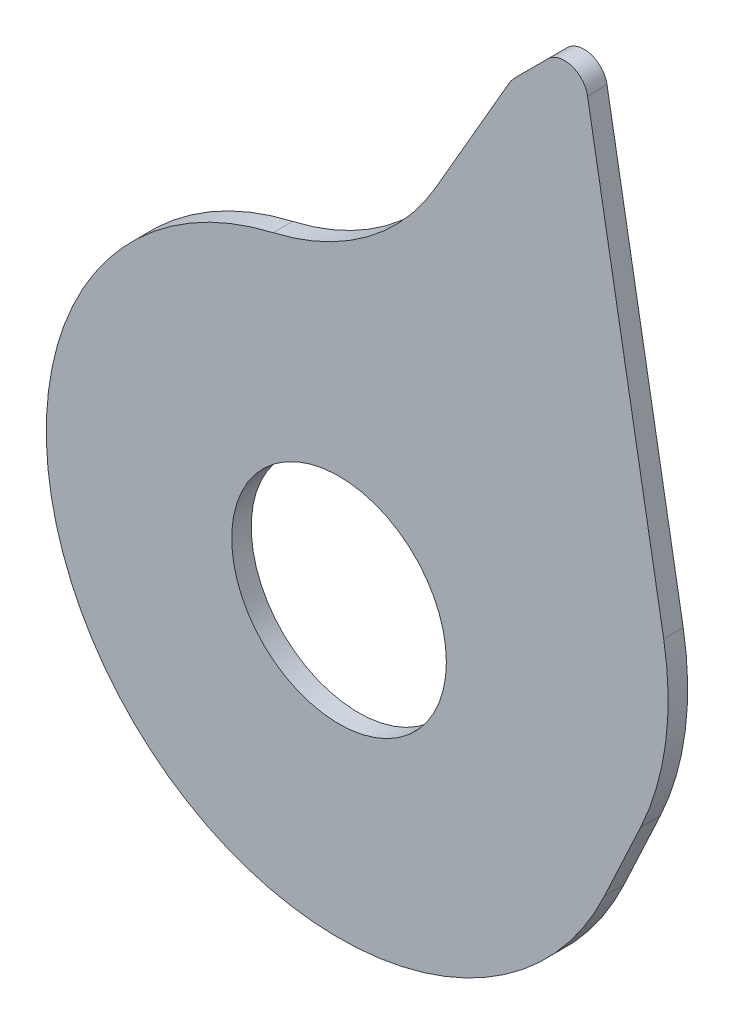
ISO-10303-21;
HEADER;
FILE_DESCRIPTION(('STEP AP214'),'2;1');
FILE_NAME('part.step','',(''),(''),'','','');
FILE_SCHEMA(('AUTOMOTIVE_DESIGN { 1 0 10303 214 1 1 1 1 }'));
ENDSEC;
DATA;
#1=APPLICATION_CONTEXT('core data for automotive mechanical design processes');
#2=APPLICATION_PROTOCOL_DEFINITION('international standard','automotive_design',2000,#1);
#3=PRODUCT_CONTEXT('',#1,'mechanical');
#4=PRODUCT('Part','Part','',(#3));
#5=PRODUCT_RELATED_PRODUCT_CATEGORY('part','',(#4));
#6=PRODUCT_DEFINITION_FORMATION('','',#4);
#7=PRODUCT_DEFINITION_CONTEXT('part definition',#1,'design');
#8=PRODUCT_DEFINITION('design','',#6,#7);
#9=PRODUCT_DEFINITION_SHAPE('','',#8);
#10=(LENGTH_UNIT() NAMED_UNIT(*) SI_UNIT(.MILLI.,.METRE.));
#11=(NAMED_UNIT(*) PLANE_ANGLE_UNIT() SI_UNIT($,.RADIAN.));
#12=(NAMED_UNIT(*) SI_UNIT($,.STERADIAN.) SOLID_ANGLE_UNIT());
#13=UNCERTAINTY_MEASURE_WITH_UNIT(LENGTH_MEASURE(1.E-05),#10,'distance_accuracy_value','');
#14=(GEOMETRIC_REPRESENTATION_CONTEXT(3) GLOBAL_UNCERTAINTY_ASSIGNED_CONTEXT((#13)) GLOBAL_UNIT_ASSIGNED_CONTEXT((#10,
#11,#12)) REPRESENTATION_CONTEXT('',''));
#15=CARTESIAN_POINT('',(0.,0.,0.));
#16=DIRECTION('',(0.,0.,1.));
#17=DIRECTION('',(1.,0.,0.));
#18=AXIS2_PLACEMENT_3D('',#15,#16,#17);
#19=CARTESIAN_POINT('',(0.,0.,5.));
#20=DIRECTION('',(0.,0.,1.));
#21=DIRECTION('',(1.,0.,0.));
#22=AXIS2_PLACEMENT_3D('',#19,#20,#21);
#23=PLANE('',#22);
#24=CARTESIAN_POINT('',(0.,0.,5.));
#25=DIRECTION('',(0.,0.,1.));
#26=DIRECTION('',(1.,0.,0.));
#27=AXIS2_PLACEMENT_3D('',#24,#25,#26);
#28=CIRCLE('',#27,75.);
#29=CARTESIAN_POINT('',(-16.8857684014529,73.0744197752709,5.));
#30=VERTEX_POINT('',#29);
#31=CARTESIAN_POINT('',(67.9730840277487,-31.6963696305528,5.));
#32=VERTEX_POINT('',#31);
#33=EDGE_CURVE('E159',#30,#32,#28,.T.);
#34=ORIENTED_EDGE('',*,*,#33,.T.);
#35=DIRECTION('',(0.422618261740703,0.906307787036648,0.));
#36=VECTOR('',#35,1.);
#37=CARTESIAN_POINT('',(77.286827824146,-11.7229816033258,5.));
#38=LINE('',#37,#36);
#39=CARTESIAN_POINT('',(77.286827824146,-11.7229816033258,5.));
#40=VERTEX_POINT('',#39);
#41=EDGE_CURVE('E102',#32,#40,#38,.T.);
#42=ORIENTED_EDGE('',*,*,#41,.T.);
#43=CARTESIAN_POINT('',(9.31374379639742,19.9733880272269,5.));
#44=DIRECTION('',(0.,0.,1.));
#45=DIRECTION('',(-1.,0.,0.));
#46=AXIS2_PLACEMENT_3D('',#43,#44,#45);
#47=CIRCLE('',#46,75.);
#48=CARTESIAN_POINT('',(83.1743252723131,32.9970013522465,5.));
#49=VERTEX_POINT('',#48);
#50=EDGE_CURVE('E177',#40,#49,#47,.T.);
#51=ORIENTED_EDGE('',*,*,#50,.T.);
#52=DIRECTION('',(-0.173648177666927,0.984807753012209,0.));
#53=VECTOR('',#52,1.);
#54=CARTESIAN_POINT('',(63.6633551574518,143.649211447765,5.));
#55=LINE('',#54,#53);
#56=CARTESIAN_POINT('',(63.6633551574518,143.649211447765,5.));
#57=VERTEX_POINT('',#56);
#58=EDGE_CURVE('E194',#49,#57,#55,.T.);
#59=ORIENTED_EDGE('',*,*,#58,.T.);
#60=CARTESIAN_POINT('',(57.7545086393786,142.607322381764,5.));
#61=DIRECTION('',(0.,0.,1.));
#62=DIRECTION('',(-1.,0.,0.));
#63=AXIS2_PLACEMENT_3D('',#60,#61,#62);
#64=CIRCLE('',#63,6.00000000000001);
#65=CARTESIAN_POINT('',(53.5118679522593,146.849963068883,5.));
#66=VERTEX_POINT('',#65);
#67=EDGE_CURVE('E193',#57,#66,#64,.T.);
#68=ORIENTED_EDGE('',*,*,#67,.T.);
#69=DIRECTION('',(-0.707106781186549,-0.707106781186546,0.));
#70=VECTOR('',#69,1.);
#71=CARTESIAN_POINT('',(45.1055831773481,138.443678293972,5.));
#72=LINE('',#71,#70);
#73=CARTESIAN_POINT('',(45.1055831773481,138.443678293972,5.));
#74=VERTEX_POINT('',#73);
#75=EDGE_CURVE('E124',#66,#74,#72,.T.);
#76=ORIENTED_EDGE('',*,*,#75,.T.);
#77=CARTESIAN_POINT('',(52.1766509892135,131.372610482106,5.));
#78=DIRECTION('',(0.,0.,1.));
#79=DIRECTION('',(-1.,0.,0.));
#80=AXIS2_PLACEMENT_3D('',#77,#78,#79);
#81=CIRCLE('',#80,10.);
#82=CARTESIAN_POINT('',(43.5163969513692,136.372610482106,5.));
#83=VERTEX_POINT('',#82);
#84=EDGE_CURVE('E118',#74,#83,#81,.T.);
#85=ORIENTED_EDGE('',*,*,#84,.T.);
#86=DIRECTION('',(-0.500000000000002,-0.866025403784438,0.));
#87=VECTOR('',#86,1.);
#88=CARTESIAN_POINT('',(24.771550229943,103.905583580506,5.));
#89=LINE('',#88,#87);
#90=CARTESIAN_POINT('',(24.771550229943,103.905583580506,5.));
#91=VERTEX_POINT('',#90);
#92=EDGE_CURVE('E122',#83,#91,#89,.T.);
#93=ORIENTED_EDGE('',*,*,#92,.T.);
#94=CARTESIAN_POINT('',(-31.5201010160455,136.405583580506,5.));
#95=DIRECTION('',(0.,0.,-1.));
#96=DIRECTION('',(-1.,0.,0.));
#97=AXIS2_PLACEMENT_3D('',#94,#95,#96);
#98=CIRCLE('',#97,65.);
#99=EDGE_CURVE('E56',#91,#30,#98,.T.);
#100=ORIENTED_EDGE('',*,*,#99,.T.);
#101=EDGE_LOOP('',(#34,#42,#51,#59,#68,#76,#85,#93,#100));
#102=FACE_BOUND('',#101,.T.);
#103=CARTESIAN_POINT('',(0.,0.,5.));
#104=DIRECTION('',(0.,0.,1.));
#105=DIRECTION('',(1.,0.,0.));
#106=AXIS2_PLACEMENT_3D('',#103,#104,#105);
#107=CIRCLE('',#106,27.5);
#108=CARTESIAN_POINT('',(27.5,0.,5.));
#109=VERTEX_POINT('',#108);
#110=EDGE_CURVE('E146',#109,#109,#107,.T.);
#111=ORIENTED_EDGE('',*,*,#110,.F.);
#112=EDGE_LOOP('',(#111));
#113=FACE_BOUND('',#112,.T.);
#114=ADVANCED_FACE('F39',(#102,#113),#23,.T.);
#115=CARTESIAN_POINT('',(0.,0.,0.));
#116=DIRECTION('',(0.,0.,1.));
#117=DIRECTION('',(1.,0.,0.));
#118=AXIS2_PLACEMENT_3D('',#115,#116,#117);
#119=PLANE('',#118);
#120=CARTESIAN_POINT('',(0.,0.,0.));
#121=DIRECTION('',(0.,0.,1.));
#122=DIRECTION('',(1.,0.,0.));
#123=AXIS2_PLACEMENT_3D('',#120,#121,#122);
#124=CIRCLE('',#123,75.);
#125=CARTESIAN_POINT('',(-16.8857684014529,73.0744197752709,0.));
#126=VERTEX_POINT('',#125);
#127=CARTESIAN_POINT('',(67.9730840277487,-31.6963696305528,0.));
#128=VERTEX_POINT('',#127);
#129=EDGE_CURVE('E142',#126,#128,#124,.T.);
#130=ORIENTED_EDGE('',*,*,#129,.F.);
#131=CARTESIAN_POINT('',(-31.5201010160455,136.405583580506,0.));
#132=DIRECTION('',(0.,0.,-1.));
#133=DIRECTION('',(-1.,0.,0.));
#134=AXIS2_PLACEMENT_3D('',#131,#132,#133);
#135=CIRCLE('',#134,65.);
#136=CARTESIAN_POINT('',(24.771550229943,103.905583580506,0.));
#137=VERTEX_POINT('',#136);
#138=EDGE_CURVE('E94',#137,#126,#135,.T.);
#139=ORIENTED_EDGE('',*,*,#138,.F.);
#140=DIRECTION('',(-0.500000000000002,-0.866025403784438,0.));
#141=VECTOR('',#140,1.);
#142=CARTESIAN_POINT('',(24.771550229943,103.905583580506,0.));
#143=LINE('',#142,#141);
#144=CARTESIAN_POINT('',(43.5163969513692,136.372610482106,0.));
#145=VERTEX_POINT('',#144);
#146=EDGE_CURVE('E88',#145,#137,#143,.T.);
#147=ORIENTED_EDGE('',*,*,#146,.F.);
#148=CARTESIAN_POINT('',(52.1766509892135,131.372610482106,0.));
#149=DIRECTION('',(0.,0.,1.));
#150=DIRECTION('',(-1.,0.,0.));
#151=AXIS2_PLACEMENT_3D('',#148,#149,#150);
#152=CIRCLE('',#151,10.);
#153=CARTESIAN_POINT('',(45.1055831773481,138.443678293972,0.));
#154=VERTEX_POINT('',#153);
#155=EDGE_CURVE('E132',#154,#145,#152,.T.);
#156=ORIENTED_EDGE('',*,*,#155,.F.);
#157=DIRECTION('',(-0.707106781186549,-0.707106781186546,0.));
#158=VECTOR('',#157,1.);
#159=CARTESIAN_POINT('',(45.1055831773481,138.443678293972,0.));
#160=LINE('',#159,#158);
#161=CARTESIAN_POINT('',(53.5118679522593,146.849963068883,0.));
#162=VERTEX_POINT('',#161);
#163=EDGE_CURVE('E154',#162,#154,#160,.T.);
#164=ORIENTED_EDGE('',*,*,#163,.F.);
#165=CARTESIAN_POINT('',(57.7545086393786,142.607322381764,0.));
#166=DIRECTION('',(0.,0.,1.));
#167=DIRECTION('',(-1.,0.,0.));
#168=AXIS2_PLACEMENT_3D('',#165,#166,#167);
#169=CIRCLE('',#168,6.00000000000001);
#170=CARTESIAN_POINT('',(63.6633551574518,143.649211447765,0.));
#171=VERTEX_POINT('',#170);
#172=EDGE_CURVE('E152',#171,#162,#169,.T.);
#173=ORIENTED_EDGE('',*,*,#172,.F.);
#174=DIRECTION('',(-0.173648177666927,0.984807753012209,0.));
#175=VECTOR('',#174,1.);
#176=CARTESIAN_POINT('',(63.6633551574518,143.649211447765,0.));
#177=LINE('',#176,#175);
#178=CARTESIAN_POINT('',(83.1743252723131,32.9970013522465,0.));
#179=VERTEX_POINT('',#178);
#180=EDGE_CURVE('E150',#179,#171,#177,.T.);
#181=ORIENTED_EDGE('',*,*,#180,.F.);
#182=CARTESIAN_POINT('',(9.31374379639742,19.9733880272269,0.));
#183=DIRECTION('',(0.,0.,1.));
#184=DIRECTION('',(-1.,0.,0.));
#185=AXIS2_PLACEMENT_3D('',#182,#183,#184);
#186=CIRCLE('',#185,75.);
#187=CARTESIAN_POINT('',(77.286827824146,-11.7229816033258,0.));
#188=VERTEX_POINT('',#187);
#189=EDGE_CURVE('E148',#188,#179,#186,.T.);
#190=ORIENTED_EDGE('',*,*,#189,.F.);
#191=DIRECTION('',(0.422618261740703,0.906307787036648,0.));
#192=VECTOR('',#191,1.);
#193=CARTESIAN_POINT('',(77.286827824146,-11.7229816033258,0.));
#194=LINE('',#193,#192);
#195=EDGE_CURVE('E145',#128,#188,#194,.T.);
#196=ORIENTED_EDGE('',*,*,#195,.F.);
#197=EDGE_LOOP('',(#130,#139,#147,#156,#164,#173,#181,#190,#196));
#198=FACE_BOUND('',#197,.T.);
#199=CARTESIAN_POINT('',(0.,0.,0.));
#200=DIRECTION('',(0.,0.,1.));
#201=DIRECTION('',(1.,0.,0.));
#202=AXIS2_PLACEMENT_3D('',#199,#200,#201);
#203=CIRCLE('',#202,27.5);
#204=CARTESIAN_POINT('',(27.5,0.,0.));
#205=VERTEX_POINT('',#204);
#206=EDGE_CURVE('E201',#205,#205,#203,.T.);
#207=ORIENTED_EDGE('',*,*,#206,.T.);
#208=EDGE_LOOP('',(#207));
#209=FACE_BOUND('',#208,.T.);
#210=ADVANCED_FACE('F181',(#198,#209),#119,.F.);
#211=CARTESIAN_POINT('',(0.,0.,5.));
#212=DIRECTION('',(0.,0.,-1.));
#213=DIRECTION('',(-1.,0.,0.));
#214=AXIS2_PLACEMENT_3D('',#211,#212,#213);
#215=CYLINDRICAL_SURFACE('',#214,75.);
#216=ORIENTED_EDGE('',*,*,#129,.T.);
#217=DIRECTION('',(0.,0.,-1.));
#218=VECTOR('',#217,1.);
#219=CARTESIAN_POINT('',(67.9730840277487,-31.6963696305528,5.));
#220=LINE('',#219,#218);
#221=EDGE_CURVE('E11',#32,#128,#220,.T.);
#222=ORIENTED_EDGE('',*,*,#221,.F.);
#223=ORIENTED_EDGE('',*,*,#33,.F.);
#224=DIRECTION('',(0.,0.,-1.));
#225=VECTOR('',#224,1.);
#226=CARTESIAN_POINT('',(-16.8857684014529,73.0744197752709,5.));
#227=LINE('',#226,#225);
#228=EDGE_CURVE('E138',#30,#126,#227,.T.);
#229=ORIENTED_EDGE('',*,*,#228,.T.);
#230=EDGE_LOOP('',(#216,#222,#223,#229));
#231=FACE_BOUND('',#230,.T.);
#232=ADVANCED_FACE('F41',(#231),#215,.T.);
#233=CARTESIAN_POINT('',(77.286827824146,-11.7229816033258,5.));
#234=DIRECTION('',(-0.906307787036648,0.422618261740703,0.));
#235=DIRECTION('',(-0.422618261740703,-0.906307787036648,0.));
#236=AXIS2_PLACEMENT_3D('',#233,#234,#235);
#237=PLANE('',#236);
#238=ORIENTED_EDGE('',*,*,#195,.T.);
#239=DIRECTION('',(0.,0.,-1.));
#240=VECTOR('',#239,1.);
#241=CARTESIAN_POINT('',(77.286827824146,-11.7229816033258,5.));
#242=LINE('',#241,#240);
#243=EDGE_CURVE('E48',#40,#188,#242,.T.);
#244=ORIENTED_EDGE('',*,*,#243,.F.);
#245=ORIENTED_EDGE('',*,*,#41,.F.);
#246=ORIENTED_EDGE('',*,*,#221,.T.);
#247=EDGE_LOOP('',(#238,#244,#245,#246));
#248=FACE_BOUND('',#247,.T.);
#249=ADVANCED_FACE('F233',(#248),#237,.F.);
#250=CARTESIAN_POINT('',(9.31374379639742,19.9733880272269,5.));
#251=DIRECTION('',(0.,0.,-1.));
#252=DIRECTION('',(-1.,0.,0.));
#253=AXIS2_PLACEMENT_3D('',#250,#251,#252);
#254=CYLINDRICAL_SURFACE('',#253,75.);
#255=ORIENTED_EDGE('',*,*,#189,.T.);
#256=DIRECTION('',(0.,0.,-1.));
#257=VECTOR('',#256,1.);
#258=CARTESIAN_POINT('',(83.1743252723131,32.9970013522465,5.));
#259=LINE('',#258,#257);
#260=EDGE_CURVE('E169',#49,#179,#259,.T.);
#261=ORIENTED_EDGE('',*,*,#260,.F.);
#262=ORIENTED_EDGE('',*,*,#50,.F.);
#263=ORIENTED_EDGE('',*,*,#243,.T.);
#264=EDGE_LOOP('',(#255,#261,#262,#263));
#265=FACE_BOUND('',#264,.T.);
#266=ADVANCED_FACE('F175',(#265),#254,.T.);
#267=CARTESIAN_POINT('',(63.6633551574518,143.649211447765,5.));
#268=DIRECTION('',(-0.984807753012209,-0.173648177666927,0.));
#269=DIRECTION('',(0.173648177666927,-0.984807753012209,0.));
#270=AXIS2_PLACEMENT_3D('',#267,#268,#269);
#271=PLANE('',#270);
#272=ORIENTED_EDGE('',*,*,#180,.T.);
#273=DIRECTION('',(0.,0.,-1.));
#274=VECTOR('',#273,1.);
#275=CARTESIAN_POINT('',(63.6633551574518,143.649211447765,5.));
#276=LINE('',#275,#274);
#277=EDGE_CURVE('E166',#57,#171,#276,.T.);
#278=ORIENTED_EDGE('',*,*,#277,.F.);
#279=ORIENTED_EDGE('',*,*,#58,.F.);
#280=ORIENTED_EDGE('',*,*,#260,.T.);
#281=EDGE_LOOP('',(#272,#278,#279,#280));
#282=FACE_BOUND('',#281,.T.);
#283=ADVANCED_FACE('F187',(#282),#271,.F.);
#284=CARTESIAN_POINT('',(57.7545086393786,142.607322381764,5.));
#285=DIRECTION('',(0.,0.,-1.));
#286=DIRECTION('',(-1.,0.,0.));
#287=AXIS2_PLACEMENT_3D('',#284,#285,#286);
#288=CYLINDRICAL_SURFACE('',#287,6.00000000000001);
#289=ORIENTED_EDGE('',*,*,#172,.T.);
#290=DIRECTION('',(0.,0.,-1.));
#291=VECTOR('',#290,1.);
#292=CARTESIAN_POINT('',(53.5118679522593,146.849963068883,5.));
#293=LINE('',#292,#291);
#294=EDGE_CURVE('E163',#66,#162,#293,.T.);
#295=ORIENTED_EDGE('',*,*,#294,.F.);
#296=ORIENTED_EDGE('',*,*,#67,.F.);
#297=ORIENTED_EDGE('',*,*,#277,.T.);
#298=EDGE_LOOP('',(#289,#295,#296,#297));
#299=FACE_BOUND('',#298,.T.);
#300=ADVANCED_FACE('F191',(#299),#288,.T.);
#301=CARTESIAN_POINT('',(45.1055831773481,138.443678293972,5.));
#302=DIRECTION('',(0.707106781186546,-0.707106781186549,0.));
#303=DIRECTION('',(0.707106781186549,0.707106781186546,0.));
#304=AXIS2_PLACEMENT_3D('',#301,#302,#303);
#305=PLANE('',#304);
#306=ORIENTED_EDGE('',*,*,#163,.T.);
#307=DIRECTION('',(0.,0.,-1.));
#308=VECTOR('',#307,1.);
#309=CARTESIAN_POINT('',(45.1055831773481,138.443678293972,5.));
#310=LINE('',#309,#308);
#311=EDGE_CURVE('E133',#74,#154,#310,.T.);
#312=ORIENTED_EDGE('',*,*,#311,.F.);
#313=ORIENTED_EDGE('',*,*,#75,.F.);
#314=ORIENTED_EDGE('',*,*,#294,.T.);
#315=EDGE_LOOP('',(#306,#312,#313,#314));
#316=FACE_BOUND('',#315,.T.);
#317=ADVANCED_FACE('F224',(#316),#305,.F.);
#318=CARTESIAN_POINT('',(52.1766509892135,131.372610482106,5.));
#319=DIRECTION('',(0.,0.,-1.));
#320=DIRECTION('',(-1.,0.,0.));
#321=AXIS2_PLACEMENT_3D('',#318,#319,#320);
#322=CYLINDRICAL_SURFACE('',#321,10.);
#323=ORIENTED_EDGE('',*,*,#155,.T.);
#324=DIRECTION('',(0.,0.,-1.));
#325=VECTOR('',#324,1.);
#326=CARTESIAN_POINT('',(43.5163969513692,136.372610482106,5.));
#327=LINE('',#326,#325);
#328=EDGE_CURVE('E129',#83,#145,#327,.T.);
#329=ORIENTED_EDGE('',*,*,#328,.F.);
#330=ORIENTED_EDGE('',*,*,#84,.F.);
#331=ORIENTED_EDGE('',*,*,#311,.T.);
#332=EDGE_LOOP('',(#323,#329,#330,#331));
#333=FACE_BOUND('',#332,.T.);
#334=ADVANCED_FACE('F130',(#333),#322,.T.);
#335=CARTESIAN_POINT('',(24.771550229943,103.905583580506,5.));
#336=DIRECTION('',(0.866025403784438,-0.500000000000002,0.));
#337=DIRECTION('',(0.500000000000002,0.866025403784438,0.));
#338=AXIS2_PLACEMENT_3D('',#335,#336,#337);
#339=PLANE('',#338);
#340=ORIENTED_EDGE('',*,*,#146,.T.);
#341=DIRECTION('',(0.,0.,-1.));
#342=VECTOR('',#341,1.);
#343=CARTESIAN_POINT('',(24.771550229943,103.905583580506,5.));
#344=LINE('',#343,#342);
#345=EDGE_CURVE('E134',#91,#137,#344,.T.);
#346=ORIENTED_EDGE('',*,*,#345,.F.);
#347=ORIENTED_EDGE('',*,*,#92,.F.);
#348=ORIENTED_EDGE('',*,*,#328,.T.);
#349=EDGE_LOOP('',(#340,#346,#347,#348));
#350=FACE_BOUND('',#349,.T.);
#351=ADVANCED_FACE('F136',(#350),#339,.F.);
#352=CARTESIAN_POINT('',(-31.5201010160455,136.405583580506,5.));
#353=DIRECTION('',(0.,0.,-1.));
#354=DIRECTION('',(-1.,0.,0.));
#355=AXIS2_PLACEMENT_3D('',#352,#353,#354);
#356=CYLINDRICAL_SURFACE('',#355,65.);
#357=ORIENTED_EDGE('',*,*,#138,.T.);
#358=ORIENTED_EDGE('',*,*,#228,.F.);
#359=ORIENTED_EDGE('',*,*,#99,.F.);
#360=ORIENTED_EDGE('',*,*,#345,.T.);
#361=EDGE_LOOP('',(#357,#358,#359,#360));
#362=FACE_BOUND('',#361,.T.);
#363=ADVANCED_FACE('F217',(#362),#356,.F.);
#364=CARTESIAN_POINT('',(0.,0.,5.));
#365=DIRECTION('',(0.,0.,-1.));
#366=DIRECTION('',(-1.,0.,0.));
#367=AXIS2_PLACEMENT_3D('',#364,#365,#366);
#368=CYLINDRICAL_SURFACE('',#367,27.5);
#369=ORIENTED_EDGE('',*,*,#110,.T.);
#370=EDGE_LOOP('',(#369));
#371=FACE_BOUND('',#370,.T.);
#372=ORIENTED_EDGE('',*,*,#206,.F.);
#373=EDGE_LOOP('',(#372));
#374=FACE_BOUND('',#373,.T.);
#375=ADVANCED_FACE('F207',(#371,#374),#368,.F.);
#376=CLOSED_SHELL('',(#114,#210,#232,#249,#266,#283,#300,#317,#334,#351,#363,#375));
#377=MANIFOLD_SOLID_BREP('B2',#376);
#378=ADVANCED_BREP_SHAPE_REPRESENTATION('',(#18,#377),#14);
#379=SHAPE_DEFINITION_REPRESENTATION(#9,#378);
ENDSEC;
END-ISO-10303-21;
